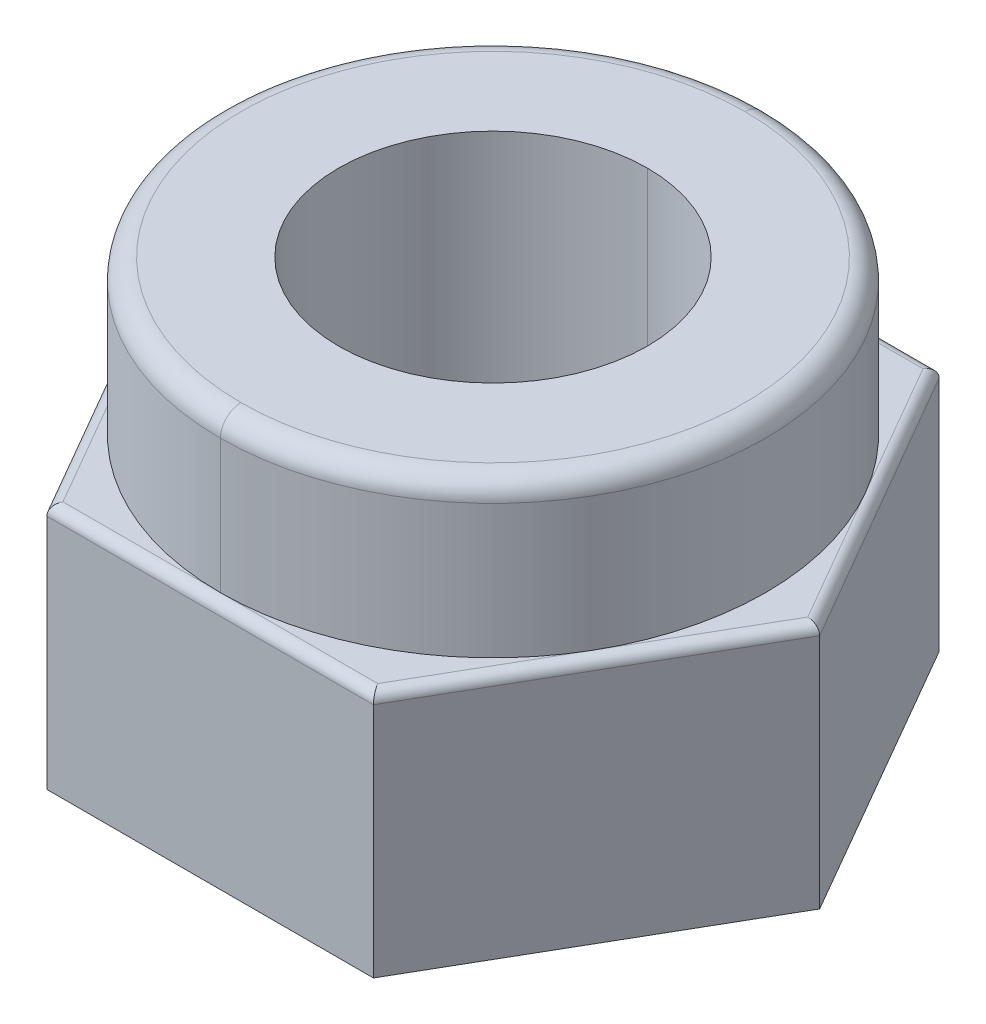
ISO-10303-21;
HEADER;
FILE_DESCRIPTION(('STEP AP214'),'2;1');
FILE_NAME('part.step','',(''),(''),'','','');
FILE_SCHEMA(('AUTOMOTIVE_DESIGN { 1 0 10303 214 1 1 1 1 }'));
ENDSEC;
DATA;
#1=APPLICATION_CONTEXT('core data for automotive mechanical design processes');
#2=APPLICATION_PROTOCOL_DEFINITION('international standard','automotive_design',2000,#1);
#3=PRODUCT_CONTEXT('',#1,'mechanical');
#4=PRODUCT('Part','Part','',(#3));
#5=PRODUCT_RELATED_PRODUCT_CATEGORY('part','',(#4));
#6=PRODUCT_DEFINITION_FORMATION('','',#4);
#7=PRODUCT_DEFINITION_CONTEXT('part definition',#1,'design');
#8=PRODUCT_DEFINITION('design','',#6,#7);
#9=PRODUCT_DEFINITION_SHAPE('','',#8);
#10=(LENGTH_UNIT() NAMED_UNIT(*) SI_UNIT(.MILLI.,.METRE.));
#11=(NAMED_UNIT(*) PLANE_ANGLE_UNIT() SI_UNIT($,.RADIAN.));
#12=(NAMED_UNIT(*) SI_UNIT($,.STERADIAN.) SOLID_ANGLE_UNIT());
#13=UNCERTAINTY_MEASURE_WITH_UNIT(LENGTH_MEASURE(1.E-05),#10,'distance_accuracy_value','');
#14=(GEOMETRIC_REPRESENTATION_CONTEXT(3) GLOBAL_UNCERTAINTY_ASSIGNED_CONTEXT((#13)) GLOBAL_UNIT_ASSIGNED_CONTEXT((#10,
#11,#12)) REPRESENTATION_CONTEXT('',''));
#15=CARTESIAN_POINT('',(0.,0.,0.));
#16=DIRECTION('',(0.,0.,1.));
#17=DIRECTION('',(1.,0.,0.));
#18=AXIS2_PLACEMENT_3D('',#15,#16,#17);
#19=CARTESIAN_POINT('',(0.,12.8,0.));
#20=DIRECTION('',(0.,-1.,0.));
#21=DIRECTION('',(0.,0.,-1.));
#22=AXIS2_PLACEMENT_3D('',#19,#20,#21);
#23=CYLINDRICAL_SURFACE('',#22,1.5);
#24=DIRECTION('',(0.,-1.,0.));
#25=VECTOR('',#24,1.);
#26=CARTESIAN_POINT('',(0.,12.8,1.5));
#27=LINE('',#26,#25);
#28=CARTESIAN_POINT('',(0.,3.9,1.5));
#29=VERTEX_POINT('',#28);
#30=CARTESIAN_POINT('',(0.,0.,1.5));
#31=VERTEX_POINT('',#30);
#32=EDGE_CURVE('E454',#29,#31,#27,.T.);
#33=ORIENTED_EDGE('',*,*,#32,.F.);
#34=CARTESIAN_POINT('',(0.,3.9,0.));
#35=DIRECTION('',(0.,-1.,0.));
#36=DIRECTION('',(0.,0.,-1.));
#37=AXIS2_PLACEMENT_3D('',#34,#35,#36);
#38=CIRCLE('',#37,1.5);
#39=CARTESIAN_POINT('',(0.,3.9,-1.5));
#40=VERTEX_POINT('',#39);
#41=EDGE_CURVE('E10',#40,#29,#38,.T.);
#42=ORIENTED_EDGE('',*,*,#41,.F.);
#43=DIRECTION('',(0.,-1.,0.));
#44=VECTOR('',#43,1.);
#45=CARTESIAN_POINT('',(0.,12.8,-1.5));
#46=LINE('',#45,#44);
#47=CARTESIAN_POINT('',(0.,0.,-1.5));
#48=VERTEX_POINT('',#47);
#49=EDGE_CURVE('E439',#40,#48,#46,.T.);
#50=ORIENTED_EDGE('',*,*,#49,.T.);
#51=CARTESIAN_POINT('',(0.,0.,0.));
#52=DIRECTION('',(0.,-1.,0.));
#53=DIRECTION('',(0.,0.,-1.));
#54=AXIS2_PLACEMENT_3D('',#51,#52,#53);
#55=CIRCLE('',#54,1.5);
#56=EDGE_CURVE('E279',#48,#31,#55,.T.);
#57=ORIENTED_EDGE('',*,*,#56,.T.);
#58=EDGE_LOOP('',(#33,#42,#50,#57));
#59=FACE_BOUND('',#58,.T.);
#60=ADVANCED_FACE('F16',(#59),#23,.F.);
#61=CARTESIAN_POINT('',(0.,3.7,0.));
#62=DIRECTION('',(0.,-1.,0.));
#63=DIRECTION('',(0.,0.,-1.));
#64=AXIS2_PLACEMENT_3D('',#61,#62,#63);
#65=TOROIDAL_SURFACE('',#64,2.45,0.2);
#66=CARTESIAN_POINT('',(0.,3.7,2.45));
#67=DIRECTION('',(1.,0.,0.));
#68=DIRECTION('',(0.,0.,-1.));
#69=AXIS2_PLACEMENT_3D('',#66,#67,#68);
#70=CIRCLE('',#69,0.2);
#71=CARTESIAN_POINT('',(0.,3.9,2.45));
#72=VERTEX_POINT('',#71);
#73=CARTESIAN_POINT('',(0.,3.7,2.65));
#74=VERTEX_POINT('',#73);
#75=EDGE_CURVE('E358',#72,#74,#70,.T.);
#76=ORIENTED_EDGE('',*,*,#75,.F.);
#77=CARTESIAN_POINT('',(0.,3.9,0.));
#78=DIRECTION('',(0.,1.,0.));
#79=DIRECTION('',(0.,0.,-1.));
#80=AXIS2_PLACEMENT_3D('',#77,#78,#79);
#81=CIRCLE('',#80,2.45);
#82=CARTESIAN_POINT('',(0.,3.9,-2.45));
#83=VERTEX_POINT('',#82);
#84=EDGE_CURVE('E24',#83,#72,#81,.T.);
#85=ORIENTED_EDGE('',*,*,#84,.F.);
#86=CARTESIAN_POINT('',(0.,3.7,-2.45));
#87=DIRECTION('',(-1.,0.,0.));
#88=DIRECTION('',(0.,0.,1.));
#89=AXIS2_PLACEMENT_3D('',#86,#87,#88);
#90=CIRCLE('',#89,0.2);
#91=CARTESIAN_POINT('',(0.,3.7,-2.65));
#92=VERTEX_POINT('',#91);
#93=EDGE_CURVE('E350',#83,#92,#90,.T.);
#94=ORIENTED_EDGE('',*,*,#93,.T.);
#95=CARTESIAN_POINT('',(0.,3.7,0.));
#96=DIRECTION('',(0.,-1.,0.));
#97=DIRECTION('',(0.,0.,-1.));
#98=AXIS2_PLACEMENT_3D('',#95,#96,#97);
#99=CIRCLE('',#98,2.65);
#100=EDGE_CURVE('E232',#74,#92,#99,.T.);
#101=ORIENTED_EDGE('',*,*,#100,.F.);
#102=EDGE_LOOP('',(#76,#85,#94,#101));
#103=FACE_BOUND('',#102,.T.);
#104=ADVANCED_FACE('F351',(#103),#65,.T.);
#105=CARTESIAN_POINT('',(0.,3.9,0.));
#106=DIRECTION('',(0.,-1.,0.));
#107=DIRECTION('',(0.,0.,-1.));
#108=AXIS2_PLACEMENT_3D('',#105,#106,#107);
#109=PLANE('',#108);
#110=ORIENTED_EDGE('',*,*,#41,.T.);
#111=CARTESIAN_POINT('',(0.,3.9,0.));
#112=DIRECTION('',(0.,-1.,0.));
#113=DIRECTION('',(0.,0.,-1.));
#114=AXIS2_PLACEMENT_3D('',#111,#112,#113);
#115=CIRCLE('',#114,1.5);
#116=EDGE_CURVE('E461',#29,#40,#115,.T.);
#117=ORIENTED_EDGE('',*,*,#116,.T.);
#118=EDGE_LOOP('',(#110,#117));
#119=FACE_BOUND('',#118,.T.);
#120=ORIENTED_EDGE('',*,*,#84,.T.);
#121=CARTESIAN_POINT('',(0.,3.9,0.));
#122=DIRECTION('',(0.,1.,0.));
#123=DIRECTION('',(0.,0.,-1.));
#124=AXIS2_PLACEMENT_3D('',#121,#122,#123);
#125=CIRCLE('',#124,2.45);
#126=EDGE_CURVE('E365',#72,#83,#125,.T.);
#127=ORIENTED_EDGE('',*,*,#126,.T.);
#128=EDGE_LOOP('',(#120,#127));
#129=FACE_BOUND('',#128,.T.);
#130=ADVANCED_FACE('F470',(#119,#129),#109,.F.);
#131=CARTESIAN_POINT('',(0.,3.9,0.));
#132=DIRECTION('',(0.,-1.,0.));
#133=DIRECTION('',(0.,0.,-1.));
#134=AXIS2_PLACEMENT_3D('',#131,#132,#133);
#135=CYLINDRICAL_SURFACE('',#134,2.65);
#136=DIRECTION('',(0.,-1.,0.));
#137=VECTOR('',#136,1.);
#138=CARTESIAN_POINT('',(0.,3.9,2.65));
#139=LINE('',#138,#137);
#140=CARTESIAN_POINT('',(0.,2.4,2.65));
#141=VERTEX_POINT('',#140);
#142=EDGE_CURVE('E333',#74,#141,#139,.T.);
#143=ORIENTED_EDGE('',*,*,#142,.F.);
#144=ORIENTED_EDGE('',*,*,#100,.T.);
#145=DIRECTION('',(0.,-1.,0.));
#146=VECTOR('',#145,1.);
#147=CARTESIAN_POINT('',(0.,3.9,-2.65));
#148=LINE('',#147,#146);
#149=CARTESIAN_POINT('',(0.,2.4,-2.65));
#150=VERTEX_POINT('',#149);
#151=EDGE_CURVE('E330',#92,#150,#148,.T.);
#152=ORIENTED_EDGE('',*,*,#151,.T.);
#153=CARTESIAN_POINT('',(0.,2.4,0.));
#154=DIRECTION('',(0.,1.,0.));
#155=DIRECTION('',(0.,0.,1.));
#156=AXIS2_PLACEMENT_3D('',#153,#154,#155);
#157=CIRCLE('',#156,2.65);
#158=CARTESIAN_POINT('',(-2.29496732002878,2.4,-1.32499999999997));
#159=VERTEX_POINT('',#158);
#160=EDGE_CURVE('E208',#150,#159,#157,.T.);
#161=ORIENTED_EDGE('',*,*,#160,.T.);
#162=CARTESIAN_POINT('',(0.,2.4,0.));
#163=DIRECTION('',(0.,1.,0.));
#164=DIRECTION('',(0.,0.,1.));
#165=AXIS2_PLACEMENT_3D('',#162,#163,#164);
#166=CIRCLE('',#165,2.65);
#167=CARTESIAN_POINT('',(-2.29496732002875,2.4,1.32500000000003));
#168=VERTEX_POINT('',#167);
#169=EDGE_CURVE('E217',#159,#168,#166,.T.);
#170=ORIENTED_EDGE('',*,*,#169,.T.);
#171=CARTESIAN_POINT('',(0.,2.4,0.));
#172=DIRECTION('',(0.,1.,0.));
#173=DIRECTION('',(0.,0.,1.));
#174=AXIS2_PLACEMENT_3D('',#171,#172,#173);
#175=CIRCLE('',#174,2.65);
#176=EDGE_CURVE('E271',#168,#141,#175,.T.);
#177=ORIENTED_EDGE('',*,*,#176,.T.);
#178=EDGE_LOOP('',(#143,#144,#152,#161,#170,#177));
#179=FACE_BOUND('',#178,.T.);
#180=ADVANCED_FACE('F328',(#179),#135,.T.);
#181=CARTESIAN_POINT('',(-2.29496732002876,2.3,1.325));
#182=DIRECTION('',(-0.5,0.,-0.866025403784439));
#183=DIRECTION('',(-0.866025403784439,0.,0.5));
#184=AXIS2_PLACEMENT_3D('',#181,#182,#183);
#185=CYLINDRICAL_SURFACE('',#184,0.1);
#186=CARTESIAN_POINT('',(-3.05995642670501,2.4,0.));
#187=CARTESIAN_POINT('',(-3.12759721819532,2.4,0.));
#188=CARTESIAN_POINT('',(-3.17542648054294,2.35857864376269,0.));
#189=CARTESIAN_POINT('',(-3.17542648054294,2.3,0.));
#190=(BOUNDED_CURVE() B_SPLINE_CURVE(3,(#186,#187,#188,#189),.UNSPECIFIED.,.F.,
.F.) B_SPLINE_CURVE_WITH_KNOTS((4,4),(1.5707963267949,3.1415926535898),
.UNSPECIFIED.) CURVE() GEOMETRIC_REPRESENTATION_ITEM() RATIONAL_B_SPLINE_CURVE((1.,
0.804737854124364,0.804737854124364,1.)) REPRESENTATION_ITEM(''));
#191=CARTESIAN_POINT('',(-3.05995642670501,2.4,0.));
#192=VERTEX_POINT('',#191);
#193=CARTESIAN_POINT('',(-3.17542648054294,2.3,0.));
#194=VERTEX_POINT('',#193);
#195=EDGE_CURVE('E311',#192,#194,#190,.T.);
#196=ORIENTED_EDGE('',*,*,#195,.T.);
#197=DIRECTION('',(-0.5,0.,-0.866025403784439));
#198=VECTOR('',#197,1.);
#199=CARTESIAN_POINT('',(-3.17542648054294,2.3,0.));
#200=LINE('',#199,#198);
#201=CARTESIAN_POINT('',(-1.58771324027147,2.3,2.75));
#202=VERTEX_POINT('',#201);
#203=EDGE_CURVE('E175',#202,#194,#200,.T.);
#204=ORIENTED_EDGE('',*,*,#203,.F.);
#205=CARTESIAN_POINT('',(-1.58771324027147,2.3,2.75));
#206=CARTESIAN_POINT('',(-1.58771324027147,2.35857864376269,2.75));
#207=CARTESIAN_POINT('',(-1.56379860909766,2.4,2.70857864376269));
#208=CARTESIAN_POINT('',(-1.52997821335251,2.4,2.65));
#209=(BOUNDED_CURVE() B_SPLINE_CURVE(3,(#205,#206,#207,#208),.UNSPECIFIED.,.F.,
.F.) B_SPLINE_CURVE_WITH_KNOTS((4,4),(0.,1.5707963267949),
.UNSPECIFIED.) CURVE() GEOMETRIC_REPRESENTATION_ITEM() RATIONAL_B_SPLINE_CURVE((1.,
0.804737854124365,0.804737854124365,1.)) REPRESENTATION_ITEM(''));
#210=CARTESIAN_POINT('',(-1.52997821335251,2.4,2.65));
#211=VERTEX_POINT('',#210);
#212=EDGE_CURVE('E37',#202,#211,#209,.T.);
#213=ORIENTED_EDGE('',*,*,#212,.T.);
#214=DIRECTION('',(0.5,0.,0.866025403784439));
#215=VECTOR('',#214,1.);
#216=CARTESIAN_POINT('',(-1.50111069989303,2.4,2.7));
#217=LINE('',#216,#215);
#218=EDGE_CURVE('E275',#168,#211,#217,.T.);
#219=ORIENTED_EDGE('',*,*,#218,.F.);
#220=DIRECTION('',(0.5,0.,0.866025403784439));
#221=VECTOR('',#220,1.);
#222=CARTESIAN_POINT('',(-1.50111069989303,2.4,2.7));
#223=LINE('',#222,#221);
#224=EDGE_CURVE('E225',#192,#168,#223,.T.);
#225=ORIENTED_EDGE('',*,*,#224,.F.);
#226=EDGE_LOOP('',(#196,#204,#213,#219,#225));
#227=FACE_BOUND('',#226,.T.);
#228=ADVANCED_FACE('F401',(#227),#185,.T.);
#229=CARTESIAN_POINT('',(0.,2.3,2.65));
#230=DIRECTION('',(-1.,0.,0.));
#231=DIRECTION('',(0.,0.,1.));
#232=AXIS2_PLACEMENT_3D('',#229,#230,#231);
#233=CYLINDRICAL_SURFACE('',#232,0.1);
#234=CARTESIAN_POINT('',(1.58771324027147,2.3,2.75));
#235=CARTESIAN_POINT('',(1.58771324027147,2.35857864376269,2.75));
#236=CARTESIAN_POINT('',(1.56379860909766,2.4,2.70857864376269));
#237=CARTESIAN_POINT('',(1.52997821335251,2.4,2.65));
#238=(BOUNDED_CURVE() B_SPLINE_CURVE(3,(#234,#235,#236,#237),.UNSPECIFIED.,.F.,
.F.) B_SPLINE_CURVE_WITH_KNOTS((4,4),(3.1415926535898,4.71238898038469),
.UNSPECIFIED.) CURVE() GEOMETRIC_REPRESENTATION_ITEM() RATIONAL_B_SPLINE_CURVE((1.,
0.804737854124366,0.804737854124366,1.)) REPRESENTATION_ITEM(''));
#239=CARTESIAN_POINT('',(1.58771324027147,2.3,2.75));
#240=VERTEX_POINT('',#239);
#241=CARTESIAN_POINT('',(1.52997821335251,2.4,2.65));
#242=VERTEX_POINT('',#241);
#243=EDGE_CURVE('E303',#240,#242,#238,.T.);
#244=ORIENTED_EDGE('',*,*,#243,.T.);
#245=DIRECTION('',(1.,0.,0.));
#246=VECTOR('',#245,1.);
#247=CARTESIAN_POINT('',(1.58771324027147,2.4,2.65));
#248=LINE('',#247,#246);
#249=EDGE_CURVE('E347',#141,#242,#248,.T.);
#250=ORIENTED_EDGE('',*,*,#249,.F.);
#251=DIRECTION('',(1.,0.,0.));
#252=VECTOR('',#251,1.);
#253=CARTESIAN_POINT('',(1.58771324027147,2.4,2.65));
#254=LINE('',#253,#252);
#255=EDGE_CURVE('E276',#211,#141,#254,.T.);
#256=ORIENTED_EDGE('',*,*,#255,.F.);
#257=ORIENTED_EDGE('',*,*,#212,.F.);
#258=DIRECTION('',(-1.,0.,0.));
#259=VECTOR('',#258,1.);
#260=CARTESIAN_POINT('',(-1.58771324027147,2.3,2.75));
#261=LINE('',#260,#259);
#262=EDGE_CURVE('E236',#240,#202,#261,.T.);
#263=ORIENTED_EDGE('',*,*,#262,.F.);
#264=EDGE_LOOP('',(#244,#250,#256,#257,#263));
#265=FACE_BOUND('',#264,.T.);
#266=ADVANCED_FACE('F412',(#265),#233,.T.);
#267=CARTESIAN_POINT('',(-2.29496732002877,2.3,-1.325));
#268=DIRECTION('',(0.5,0.,-0.866025403784439));
#269=DIRECTION('',(-0.866025403784439,0.,-0.5));
#270=AXIS2_PLACEMENT_3D('',#267,#268,#269);
#271=CYLINDRICAL_SURFACE('',#270,0.1);
#272=CARTESIAN_POINT('',(-1.52997821335251,2.4,-2.65));
#273=CARTESIAN_POINT('',(-1.56379860909766,2.4,-2.70857864376269));
#274=CARTESIAN_POINT('',(-1.58771324027147,2.35857864376269,-2.75));
#275=CARTESIAN_POINT('',(-1.58771324027147,2.3,-2.75));
#276=(BOUNDED_CURVE() B_SPLINE_CURVE(3,(#272,#273,#274,#275),.UNSPECIFIED.,.F.,
.F.) B_SPLINE_CURVE_WITH_KNOTS((4,4),(1.57079632679489,3.1415926535898),
.UNSPECIFIED.) CURVE() GEOMETRIC_REPRESENTATION_ITEM() RATIONAL_B_SPLINE_CURVE((1.,
0.804737854124364,0.804737854124364,1.)) REPRESENTATION_ITEM(''));
#277=CARTESIAN_POINT('',(-1.52997821335251,2.4,-2.65));
#278=VERTEX_POINT('',#277);
#279=CARTESIAN_POINT('',(-1.58771324027147,2.3,-2.75));
#280=VERTEX_POINT('',#279);
#281=EDGE_CURVE('E295',#278,#280,#276,.T.);
#282=ORIENTED_EDGE('',*,*,#281,.T.);
#283=DIRECTION('',(0.5,0.,-0.866025403784439));
#284=VECTOR('',#283,1.);
#285=CARTESIAN_POINT('',(-1.58771324027147,2.3,-2.75));
#286=LINE('',#285,#284);
#287=EDGE_CURVE('E176',#194,#280,#286,.T.);
#288=ORIENTED_EDGE('',*,*,#287,.F.);
#289=ORIENTED_EDGE('',*,*,#195,.F.);
#290=DIRECTION('',(-0.5,0.,0.866025403784439));
#291=VECTOR('',#290,1.);
#292=CARTESIAN_POINT('',(-3.0888239401645,2.4,0.05));
#293=LINE('',#292,#291);
#294=EDGE_CURVE('E221',#159,#192,#293,.T.);
#295=ORIENTED_EDGE('',*,*,#294,.F.);
#296=DIRECTION('',(-0.5,0.,0.866025403784439));
#297=VECTOR('',#296,1.);
#298=CARTESIAN_POINT('',(-3.0888239401645,2.4,0.05));
#299=LINE('',#298,#297);
#300=EDGE_CURVE('E213',#278,#159,#299,.T.);
#301=ORIENTED_EDGE('',*,*,#300,.F.);
#302=EDGE_LOOP('',(#282,#288,#289,#295,#301));
#303=FACE_BOUND('',#302,.T.);
#304=ADVANCED_FACE('F397',(#303),#271,.T.);
#305=CARTESIAN_POINT('',(2.29496732002877,2.3,1.325));
#306=DIRECTION('',(-0.5,0.,0.866025403784439));
#307=DIRECTION('',(0.866025403784439,0.,0.5));
#308=AXIS2_PLACEMENT_3D('',#305,#306,#307);
#309=CYLINDRICAL_SURFACE('',#308,0.1);
#310=CARTESIAN_POINT('',(3.17542648054294,2.3,0.));
#311=CARTESIAN_POINT('',(3.17542648054294,2.35857864376269,0.));
#312=CARTESIAN_POINT('',(3.12759721819532,2.4,0.));
#313=CARTESIAN_POINT('',(3.05995642670501,2.4,0.));
#314=(BOUNDED_CURVE() B_SPLINE_CURVE(3,(#310,#311,#312,#313),.UNSPECIFIED.,.F.,
.F.) B_SPLINE_CURVE_WITH_KNOTS((4,4),(3.1415926535898,4.71238898038469),
.UNSPECIFIED.) CURVE() GEOMETRIC_REPRESENTATION_ITEM() RATIONAL_B_SPLINE_CURVE((1.,
0.804737854124365,0.804737854124365,1.)) REPRESENTATION_ITEM(''));
#315=CARTESIAN_POINT('',(3.17542648054294,2.3,0.));
#316=VERTEX_POINT('',#315);
#317=CARTESIAN_POINT('',(3.05995642670501,2.4,0.));
#318=VERTEX_POINT('',#317);
#319=EDGE_CURVE('E282',#316,#318,#314,.T.);
#320=ORIENTED_EDGE('',*,*,#319,.T.);
#321=DIRECTION('',(0.5,0.,-0.866025403784439));
#322=VECTOR('',#321,1.);
#323=CARTESIAN_POINT('',(3.0888239401645,2.4,-0.05));
#324=LINE('',#323,#322);
#325=CARTESIAN_POINT('',(2.29496732002878,2.4,1.32499999999997));
#326=VERTEX_POINT('',#325);
#327=EDGE_CURVE('E382',#326,#318,#324,.T.);
#328=ORIENTED_EDGE('',*,*,#327,.F.);
#329=DIRECTION('',(0.5,0.,-0.866025403784439));
#330=VECTOR('',#329,1.);
#331=CARTESIAN_POINT('',(3.0888239401645,2.4,-0.05));
#332=LINE('',#331,#330);
#333=EDGE_CURVE('E418',#242,#326,#332,.T.);
#334=ORIENTED_EDGE('',*,*,#333,.F.);
#335=ORIENTED_EDGE('',*,*,#243,.F.);
#336=DIRECTION('',(-0.5,0.,0.866025403784439));
#337=VECTOR('',#336,1.);
#338=CARTESIAN_POINT('',(1.58771324027147,2.3,2.75));
#339=LINE('',#338,#337);
#340=EDGE_CURVE('E249',#316,#240,#339,.T.);
#341=ORIENTED_EDGE('',*,*,#340,.F.);
#342=EDGE_LOOP('',(#320,#328,#334,#335,#341));
#343=FACE_BOUND('',#342,.T.);
#344=ADVANCED_FACE('F530',(#343),#309,.T.);
#345=CARTESIAN_POINT('',(0.,2.3,-2.65));
#346=DIRECTION('',(1.,0.,0.));
#347=DIRECTION('',(0.,0.,-1.));
#348=AXIS2_PLACEMENT_3D('',#345,#346,#347);
#349=CYLINDRICAL_SURFACE('',#348,0.1);
#350=CARTESIAN_POINT('',(1.5299782133525,2.4,-2.65));
#351=CARTESIAN_POINT('',(1.56379860909766,2.4,-2.70857864376269));
#352=CARTESIAN_POINT('',(1.58771324027147,2.35857864376269,-2.75));
#353=CARTESIAN_POINT('',(1.58771324027147,2.3,-2.75));
#354=(BOUNDED_CURVE() B_SPLINE_CURVE(3,(#350,#351,#352,#353),.UNSPECIFIED.,.F.,
.F.) B_SPLINE_CURVE_WITH_KNOTS((4,4),(1.5707963267949,3.1415926535898),
.UNSPECIFIED.) CURVE() GEOMETRIC_REPRESENTATION_ITEM() RATIONAL_B_SPLINE_CURVE((1.,
0.804737854124366,0.804737854124366,1.)) REPRESENTATION_ITEM(''));
#355=CARTESIAN_POINT('',(1.5299782133525,2.4,-2.65));
#356=VERTEX_POINT('',#355);
#357=CARTESIAN_POINT('',(1.58771324027147,2.3,-2.75));
#358=VERTEX_POINT('',#357);
#359=EDGE_CURVE('E287',#356,#358,#354,.T.);
#360=ORIENTED_EDGE('',*,*,#359,.T.);
#361=DIRECTION('',(1.,0.,0.));
#362=VECTOR('',#361,1.);
#363=CARTESIAN_POINT('',(1.58771324027147,2.3,-2.75));
#364=LINE('',#363,#362);
#365=EDGE_CURVE('E188',#280,#358,#364,.T.);
#366=ORIENTED_EDGE('',*,*,#365,.F.);
#367=ORIENTED_EDGE('',*,*,#281,.F.);
#368=DIRECTION('',(-1.,0.,0.));
#369=VECTOR('',#368,1.);
#370=CARTESIAN_POINT('',(-1.58771324027147,2.4,-2.65));
#371=LINE('',#370,#369);
#372=EDGE_CURVE('E210',#150,#278,#371,.T.);
#373=ORIENTED_EDGE('',*,*,#372,.F.);
#374=DIRECTION('',(-1.,0.,0.));
#375=VECTOR('',#374,1.);
#376=CARTESIAN_POINT('',(-1.58771324027147,2.4,-2.65));
#377=LINE('',#376,#375);
#378=EDGE_CURVE('E377',#356,#150,#377,.T.);
#379=ORIENTED_EDGE('',*,*,#378,.F.);
#380=EDGE_LOOP('',(#360,#366,#367,#373,#379));
#381=FACE_BOUND('',#380,.T.);
#382=ADVANCED_FACE('F541',(#381),#349,.T.);
#383=CARTESIAN_POINT('',(2.29496732002876,2.3,-1.325));
#384=DIRECTION('',(0.5,0.,0.866025403784438));
#385=DIRECTION('',(0.866025403784438,0.,-0.5));
#386=AXIS2_PLACEMENT_3D('',#383,#384,#385);
#387=CYLINDRICAL_SURFACE('',#386,0.1);
#388=ORIENTED_EDGE('',*,*,#319,.F.);
#389=DIRECTION('',(0.5,0.,0.866025403784439));
#390=VECTOR('',#389,1.);
#391=CARTESIAN_POINT('',(3.17542648054294,2.3,0.));
#392=LINE('',#391,#390);
#393=EDGE_CURVE('E204',#358,#316,#392,.T.);
#394=ORIENTED_EDGE('',*,*,#393,.F.);
#395=ORIENTED_EDGE('',*,*,#359,.F.);
#396=DIRECTION('',(-0.5,0.,-0.866025403784439));
#397=VECTOR('',#396,1.);
#398=CARTESIAN_POINT('',(1.50111069989303,2.4,-2.7));
#399=LINE('',#398,#397);
#400=CARTESIAN_POINT('',(2.29496732002875,2.4,-1.32500000000003));
#401=VERTEX_POINT('',#400);
#402=EDGE_CURVE('E374',#401,#356,#399,.T.);
#403=ORIENTED_EDGE('',*,*,#402,.F.);
#404=DIRECTION('',(-0.5,0.,-0.866025403784439));
#405=VECTOR('',#404,1.);
#406=CARTESIAN_POINT('',(1.50111069989303,2.4,-2.7));
#407=LINE('',#406,#405);
#408=EDGE_CURVE('E378',#318,#401,#407,.T.);
#409=ORIENTED_EDGE('',*,*,#408,.F.);
#410=EDGE_LOOP('',(#388,#394,#395,#403,#409));
#411=FACE_BOUND('',#410,.T.);
#412=ADVANCED_FACE('F553',(#411),#387,.T.);
#413=CARTESIAN_POINT('',(0.,0.,0.));
#414=DIRECTION('',(0.,1.,0.));
#415=DIRECTION('',(1.,0.,0.));
#416=AXIS2_PLACEMENT_3D('',#413,#414,#415);
#417=PLANE('',#416);
#418=ORIENTED_EDGE('',*,*,#56,.F.);
#419=CARTESIAN_POINT('',(0.,0.,0.));
#420=DIRECTION('',(0.,-1.,0.));
#421=DIRECTION('',(0.,0.,-1.));
#422=AXIS2_PLACEMENT_3D('',#419,#420,#421);
#423=CIRCLE('',#422,1.5);
#424=EDGE_CURVE('E450',#31,#48,#423,.T.);
#425=ORIENTED_EDGE('',*,*,#424,.F.);
#426=EDGE_LOOP('',(#418,#425));
#427=FACE_BOUND('',#426,.T.);
#428=DIRECTION('',(1.,0.,0.));
#429=VECTOR('',#428,1.);
#430=CARTESIAN_POINT('',(-1.58771324027147,0.,2.75));
#431=LINE('',#430,#429);
#432=CARTESIAN_POINT('',(-1.58771324027147,0.,2.75));
#433=VERTEX_POINT('',#432);
#434=CARTESIAN_POINT('',(1.58771324027147,0.,2.75));
#435=VERTEX_POINT('',#434);
#436=EDGE_CURVE('E244',#433,#435,#431,.T.);
#437=ORIENTED_EDGE('',*,*,#436,.F.);
#438=DIRECTION('',(0.5,0.,0.866025403784439));
#439=VECTOR('',#438,1.);
#440=CARTESIAN_POINT('',(-3.17542648054294,0.,0.));
#441=LINE('',#440,#439);
#442=CARTESIAN_POINT('',(-3.17542648054294,0.,0.));
#443=VERTEX_POINT('',#442);
#444=EDGE_CURVE('E51',#443,#433,#441,.T.);
#445=ORIENTED_EDGE('',*,*,#444,.F.);
#446=DIRECTION('',(-0.5,0.,0.866025403784439));
#447=VECTOR('',#446,1.);
#448=CARTESIAN_POINT('',(-1.58771324027147,0.,-2.75));
#449=LINE('',#448,#447);
#450=CARTESIAN_POINT('',(-1.58771324027147,0.,-2.75));
#451=VERTEX_POINT('',#450);
#452=EDGE_CURVE('E165',#451,#443,#449,.T.);
#453=ORIENTED_EDGE('',*,*,#452,.F.);
#454=DIRECTION('',(-1.,0.,0.));
#455=VECTOR('',#454,1.);
#456=CARTESIAN_POINT('',(1.58771324027147,0.,-2.75));
#457=LINE('',#456,#455);
#458=CARTESIAN_POINT('',(1.58771324027147,0.,-2.75));
#459=VERTEX_POINT('',#458);
#460=EDGE_CURVE('E168',#459,#451,#457,.T.);
#461=ORIENTED_EDGE('',*,*,#460,.F.);
#462=DIRECTION('',(-0.5,0.,-0.866025403784438));
#463=VECTOR('',#462,1.);
#464=CARTESIAN_POINT('',(3.17542648054294,0.,0.));
#465=LINE('',#464,#463);
#466=CARTESIAN_POINT('',(3.17542648054294,0.,0.));
#467=VERTEX_POINT('',#466);
#468=EDGE_CURVE('E195',#467,#459,#465,.T.);
#469=ORIENTED_EDGE('',*,*,#468,.F.);
#470=DIRECTION('',(0.5,0.,-0.866025403784439));
#471=VECTOR('',#470,1.);
#472=CARTESIAN_POINT('',(1.58771324027147,0.,2.75));
#473=LINE('',#472,#471);
#474=EDGE_CURVE('E255',#435,#467,#473,.T.);
#475=ORIENTED_EDGE('',*,*,#474,.F.);
#476=EDGE_LOOP('',(#437,#445,#453,#461,#469,#475));
#477=FACE_BOUND('',#476,.T.);
#478=ADVANCED_FACE('F167',(#427,#477),#417,.F.);
#479=CARTESIAN_POINT('',(0.,2.4,0.));
#480=DIRECTION('',(0.,1.,0.));
#481=DIRECTION('',(1.,0.,0.));
#482=AXIS2_PLACEMENT_3D('',#479,#480,#481);
#483=PLANE('',#482);
#484=ORIENTED_EDGE('',*,*,#176,.F.);
#485=ORIENTED_EDGE('',*,*,#218,.T.);
#486=ORIENTED_EDGE('',*,*,#255,.T.);
#487=EDGE_LOOP('',(#484,#485,#486));
#488=FACE_BOUND('',#487,.T.);
#489=ADVANCED_FACE('F407',(#488),#483,.T.);
#490=CARTESIAN_POINT('',(-3.17542648054294,2.4,0.));
#491=DIRECTION('',(0.866025403784439,0.,-0.5));
#492=DIRECTION('',(0.,-1.,0.));
#493=AXIS2_PLACEMENT_3D('',#490,#491,#492);
#494=PLANE('',#493);
#495=DIRECTION('',(0.,-1.,0.));
#496=VECTOR('',#495,1.);
#497=CARTESIAN_POINT('',(-1.58771324027147,2.4,2.75));
#498=LINE('',#497,#496);
#499=EDGE_CURVE('E240',#202,#433,#498,.T.);
#500=ORIENTED_EDGE('',*,*,#499,.F.);
#501=ORIENTED_EDGE('',*,*,#203,.T.);
#502=DIRECTION('',(0.,-1.,0.));
#503=VECTOR('',#502,1.);
#504=CARTESIAN_POINT('',(-3.17542648054294,2.4,0.));
#505=LINE('',#504,#503);
#506=EDGE_CURVE('E187',#194,#443,#505,.T.);
#507=ORIENTED_EDGE('',*,*,#506,.T.);
#508=ORIENTED_EDGE('',*,*,#444,.T.);
#509=EDGE_LOOP('',(#500,#501,#507,#508));
#510=FACE_BOUND('',#509,.T.);
#511=ADVANCED_FACE('F577',(#510),#494,.F.);
#512=CARTESIAN_POINT('',(-1.58771324027147,2.4,-2.75));
#513=DIRECTION('',(0.866025403784439,0.,0.5));
#514=DIRECTION('',(0.,-1.,0.));
#515=AXIS2_PLACEMENT_3D('',#512,#513,#514);
#516=PLANE('',#515);
#517=ORIENTED_EDGE('',*,*,#506,.F.);
#518=ORIENTED_EDGE('',*,*,#287,.T.);
#519=DIRECTION('',(0.,-1.,0.));
#520=VECTOR('',#519,1.);
#521=CARTESIAN_POINT('',(-1.58771324027147,2.4,-2.75));
#522=LINE('',#521,#520);
#523=EDGE_CURVE('E183',#280,#451,#522,.T.);
#524=ORIENTED_EDGE('',*,*,#523,.T.);
#525=ORIENTED_EDGE('',*,*,#452,.T.);
#526=EDGE_LOOP('',(#517,#518,#524,#525));
#527=FACE_BOUND('',#526,.T.);
#528=ADVANCED_FACE('F191',(#527),#516,.F.);
#529=CARTESIAN_POINT('',(1.58771324027147,2.4,-2.75));
#530=DIRECTION('',(0.,0.,1.));
#531=DIRECTION('',(1.,0.,0.));
#532=AXIS2_PLACEMENT_3D('',#529,#530,#531);
#533=PLANE('',#532);
#534=ORIENTED_EDGE('',*,*,#523,.F.);
#535=ORIENTED_EDGE('',*,*,#365,.T.);
#536=DIRECTION('',(0.,-1.,0.));
#537=VECTOR('',#536,1.);
#538=CARTESIAN_POINT('',(1.58771324027147,2.4,-2.75));
#539=LINE('',#538,#537);
#540=EDGE_CURVE('E185',#358,#459,#539,.T.);
#541=ORIENTED_EDGE('',*,*,#540,.T.);
#542=ORIENTED_EDGE('',*,*,#460,.T.);
#543=EDGE_LOOP('',(#534,#535,#541,#542));
#544=FACE_BOUND('',#543,.T.);
#545=ADVANCED_FACE('F181',(#544),#533,.F.);
#546=CARTESIAN_POINT('',(3.17542648054294,2.4,0.));
#547=DIRECTION('',(-0.866025403784439,0.,0.5));
#548=DIRECTION('',(0.,1.,0.));
#549=AXIS2_PLACEMENT_3D('',#546,#547,#548);
#550=PLANE('',#549);
#551=ORIENTED_EDGE('',*,*,#540,.F.);
#552=ORIENTED_EDGE('',*,*,#393,.T.);
#553=DIRECTION('',(0.,-1.,0.));
#554=VECTOR('',#553,1.);
#555=CARTESIAN_POINT('',(3.17542648054294,2.4,0.));
#556=LINE('',#555,#554);
#557=EDGE_CURVE('E245',#316,#467,#556,.T.);
#558=ORIENTED_EDGE('',*,*,#557,.T.);
#559=ORIENTED_EDGE('',*,*,#468,.T.);
#560=EDGE_LOOP('',(#551,#552,#558,#559));
#561=FACE_BOUND('',#560,.T.);
#562=ADVANCED_FACE('F621',(#561),#550,.F.);
#563=CARTESIAN_POINT('',(1.58771324027147,2.4,2.75));
#564=DIRECTION('',(-0.866025403784439,0.,-0.5));
#565=DIRECTION('',(-0.5,0.,0.866025403784439));
#566=AXIS2_PLACEMENT_3D('',#563,#564,#565);
#567=PLANE('',#566);
#568=ORIENTED_EDGE('',*,*,#557,.F.);
#569=ORIENTED_EDGE('',*,*,#340,.T.);
#570=DIRECTION('',(0.,-1.,0.));
#571=VECTOR('',#570,1.);
#572=CARTESIAN_POINT('',(1.58771324027147,2.4,2.75));
#573=LINE('',#572,#571);
#574=EDGE_CURVE('E229',#240,#435,#573,.T.);
#575=ORIENTED_EDGE('',*,*,#574,.T.);
#576=ORIENTED_EDGE('',*,*,#474,.T.);
#577=EDGE_LOOP('',(#568,#569,#575,#576));
#578=FACE_BOUND('',#577,.T.);
#579=ADVANCED_FACE('F615',(#578),#567,.F.);
#580=CARTESIAN_POINT('',(-1.58771324027147,2.4,2.75));
#581=DIRECTION('',(0.,0.,-1.));
#582=DIRECTION('',(0.,-1.,0.));
#583=AXIS2_PLACEMENT_3D('',#580,#581,#582);
#584=PLANE('',#583);
#585=ORIENTED_EDGE('',*,*,#574,.F.);
#586=ORIENTED_EDGE('',*,*,#262,.T.);
#587=ORIENTED_EDGE('',*,*,#499,.T.);
#588=ORIENTED_EDGE('',*,*,#436,.T.);
#589=EDGE_LOOP('',(#585,#586,#587,#588));
#590=FACE_BOUND('',#589,.T.);
#591=ADVANCED_FACE('F620',(#590),#584,.F.);
#592=CARTESIAN_POINT('',(0.,2.4,0.));
#593=DIRECTION('',(0.,1.,0.));
#594=DIRECTION('',(1.,0.,0.));
#595=AXIS2_PLACEMENT_3D('',#592,#593,#594);
#596=PLANE('',#595);
#597=ORIENTED_EDGE('',*,*,#169,.F.);
#598=ORIENTED_EDGE('',*,*,#294,.T.);
#599=ORIENTED_EDGE('',*,*,#224,.T.);
#600=EDGE_LOOP('',(#597,#598,#599));
#601=FACE_BOUND('',#600,.T.);
#602=ADVANCED_FACE('F400',(#601),#596,.T.);
#603=CARTESIAN_POINT('',(0.,2.4,0.));
#604=DIRECTION('',(0.,1.,0.));
#605=DIRECTION('',(1.,0.,0.));
#606=AXIS2_PLACEMENT_3D('',#603,#604,#605);
#607=PLANE('',#606);
#608=ORIENTED_EDGE('',*,*,#160,.F.);
#609=ORIENTED_EDGE('',*,*,#372,.T.);
#610=ORIENTED_EDGE('',*,*,#300,.T.);
#611=EDGE_LOOP('',(#608,#609,#610));
#612=FACE_BOUND('',#611,.T.);
#613=ADVANCED_FACE('F394',(#612),#607,.T.);
#614=CARTESIAN_POINT('',(0.,2.4,0.));
#615=DIRECTION('',(0.,1.,0.));
#616=DIRECTION('',(1.,0.,0.));
#617=AXIS2_PLACEMENT_3D('',#614,#615,#616);
#618=PLANE('',#617);
#619=CARTESIAN_POINT('',(0.,2.4,0.));
#620=DIRECTION('',(0.,1.,0.));
#621=DIRECTION('',(0.,0.,1.));
#622=AXIS2_PLACEMENT_3D('',#619,#620,#621);
#623=CIRCLE('',#622,2.65);
#624=EDGE_CURVE('E345',#401,#150,#623,.T.);
#625=ORIENTED_EDGE('',*,*,#624,.F.);
#626=ORIENTED_EDGE('',*,*,#402,.T.);
#627=ORIENTED_EDGE('',*,*,#378,.T.);
#628=EDGE_LOOP('',(#625,#626,#627));
#629=FACE_BOUND('',#628,.T.);
#630=ADVANCED_FACE('F646',(#629),#618,.T.);
#631=CARTESIAN_POINT('',(0.,2.4,0.));
#632=DIRECTION('',(0.,1.,0.));
#633=DIRECTION('',(1.,0.,0.));
#634=AXIS2_PLACEMENT_3D('',#631,#632,#633);
#635=PLANE('',#634);
#636=CARTESIAN_POINT('',(0.,2.4,0.));
#637=DIRECTION('',(0.,1.,0.));
#638=DIRECTION('',(0.,0.,1.));
#639=AXIS2_PLACEMENT_3D('',#636,#637,#638);
#640=CIRCLE('',#639,2.65);
#641=EDGE_CURVE('E369',#326,#401,#640,.T.);
#642=ORIENTED_EDGE('',*,*,#641,.F.);
#643=ORIENTED_EDGE('',*,*,#327,.T.);
#644=ORIENTED_EDGE('',*,*,#408,.T.);
#645=EDGE_LOOP('',(#642,#643,#644));
#646=FACE_BOUND('',#645,.T.);
#647=ADVANCED_FACE('F657',(#646),#635,.T.);
#648=CARTESIAN_POINT('',(0.,2.4,0.));
#649=DIRECTION('',(0.,1.,0.));
#650=DIRECTION('',(1.,0.,0.));
#651=AXIS2_PLACEMENT_3D('',#648,#649,#650);
#652=PLANE('',#651);
#653=CARTESIAN_POINT('',(0.,2.4,0.));
#654=DIRECTION('',(0.,1.,0.));
#655=DIRECTION('',(0.,0.,1.));
#656=AXIS2_PLACEMENT_3D('',#653,#654,#655);
#657=CIRCLE('',#656,2.65);
#658=EDGE_CURVE('E370',#141,#326,#657,.T.);
#659=ORIENTED_EDGE('',*,*,#658,.F.);
#660=ORIENTED_EDGE('',*,*,#249,.T.);
#661=ORIENTED_EDGE('',*,*,#333,.T.);
#662=EDGE_LOOP('',(#659,#660,#661));
#663=FACE_BOUND('',#662,.T.);
#664=ADVANCED_FACE('F421',(#663),#652,.T.);
#665=CARTESIAN_POINT('',(0.,3.9,0.));
#666=DIRECTION('',(0.,-1.,0.));
#667=DIRECTION('',(0.,0.,-1.));
#668=AXIS2_PLACEMENT_3D('',#665,#666,#667);
#669=CYLINDRICAL_SURFACE('',#668,2.65);
#670=CARTESIAN_POINT('',(0.,3.7,0.));
#671=DIRECTION('',(0.,-1.,0.));
#672=DIRECTION('',(0.,0.,-1.));
#673=AXIS2_PLACEMENT_3D('',#670,#671,#672);
#674=CIRCLE('',#673,2.65);
#675=EDGE_CURVE('E341',#92,#74,#674,.T.);
#676=ORIENTED_EDGE('',*,*,#675,.T.);
#677=ORIENTED_EDGE('',*,*,#142,.T.);
#678=ORIENTED_EDGE('',*,*,#658,.T.);
#679=ORIENTED_EDGE('',*,*,#641,.T.);
#680=ORIENTED_EDGE('',*,*,#624,.T.);
#681=ORIENTED_EDGE('',*,*,#151,.F.);
#682=EDGE_LOOP('',(#676,#677,#678,#679,#680,#681));
#683=FACE_BOUND('',#682,.T.);
#684=ADVANCED_FACE('F339',(#683),#669,.T.);
#685=CARTESIAN_POINT('',(0.,3.7,0.));
#686=DIRECTION('',(0.,-1.,0.));
#687=DIRECTION('',(0.,0.,-1.));
#688=AXIS2_PLACEMENT_3D('',#685,#686,#687);
#689=TOROIDAL_SURFACE('',#688,2.45,0.2);
#690=ORIENTED_EDGE('',*,*,#126,.F.);
#691=ORIENTED_EDGE('',*,*,#75,.T.);
#692=ORIENTED_EDGE('',*,*,#675,.F.);
#693=ORIENTED_EDGE('',*,*,#93,.F.);
#694=EDGE_LOOP('',(#690,#691,#692,#693));
#695=FACE_BOUND('',#694,.T.);
#696=ADVANCED_FACE('F357',(#695),#689,.T.);
#697=CARTESIAN_POINT('',(0.,12.8,0.));
#698=DIRECTION('',(0.,-1.,0.));
#699=DIRECTION('',(0.,0.,-1.));
#700=AXIS2_PLACEMENT_3D('',#697,#698,#699);
#701=CYLINDRICAL_SURFACE('',#700,1.5);
#702=ORIENTED_EDGE('',*,*,#116,.F.);
#703=ORIENTED_EDGE('',*,*,#32,.T.);
#704=ORIENTED_EDGE('',*,*,#424,.T.);
#705=ORIENTED_EDGE('',*,*,#49,.F.);
#706=EDGE_LOOP('',(#702,#703,#704,#705));
#707=FACE_BOUND('',#706,.T.);
#708=ADVANCED_FACE('F475',(#707),#701,.F.);
#709=CLOSED_SHELL('',(#60,#104,#130,#180,#228,#266,#304,#344,#382,#412,#478,#489,#511,#528,#545,
#562,#579,#591,#602,#613,#630,#647,#664,#684,#696,#708));
#710=MANIFOLD_SOLID_BREP('B1',#709);
#711=ADVANCED_BREP_SHAPE_REPRESENTATION('',(#18,#710),#14);
#712=SHAPE_DEFINITION_REPRESENTATION(#9,#711);
ENDSEC;
END-ISO-10303-21;
